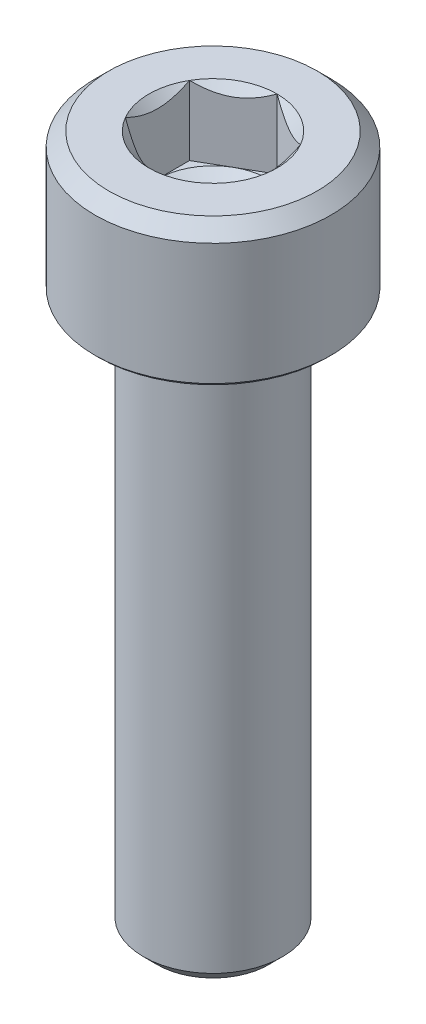
ISO-10303-21;
HEADER;
FILE_DESCRIPTION(('STEP AP214'),'2;1');
FILE_NAME('part.step','',(''),(''),'','','');
FILE_SCHEMA(('AUTOMOTIVE_DESIGN { 1 0 10303 214 1 1 1 1 }'));
ENDSEC;
DATA;
#1=APPLICATION_CONTEXT('core data for automotive mechanical design processes');
#2=APPLICATION_PROTOCOL_DEFINITION('international standard','automotive_design',2000,#1);
#3=PRODUCT_CONTEXT('',#1,'mechanical');
#4=PRODUCT('Part','Part','',(#3));
#5=PRODUCT_RELATED_PRODUCT_CATEGORY('part','',(#4));
#6=PRODUCT_DEFINITION_FORMATION('','',#4);
#7=PRODUCT_DEFINITION_CONTEXT('part definition',#1,'design');
#8=PRODUCT_DEFINITION('design','',#6,#7);
#9=PRODUCT_DEFINITION_SHAPE('','',#8);
#10=(LENGTH_UNIT() NAMED_UNIT(*) SI_UNIT(.MILLI.,.METRE.));
#11=(NAMED_UNIT(*) PLANE_ANGLE_UNIT() SI_UNIT($,.RADIAN.));
#12=(NAMED_UNIT(*) SI_UNIT($,.STERADIAN.) SOLID_ANGLE_UNIT());
#13=UNCERTAINTY_MEASURE_WITH_UNIT(LENGTH_MEASURE(1.E-05),#10,'distance_accuracy_value','');
#14=(GEOMETRIC_REPRESENTATION_CONTEXT(3) GLOBAL_UNCERTAINTY_ASSIGNED_CONTEXT((#13)) GLOBAL_UNIT_ASSIGNED_CONTEXT((#10,
#11,#12)) REPRESENTATION_CONTEXT('',''));
#15=CARTESIAN_POINT('',(0.,0.,0.));
#16=DIRECTION('',(0.,0.,1.));
#17=DIRECTION('',(1.,0.,0.));
#18=AXIS2_PLACEMENT_3D('',#15,#16,#17);
#19=CARTESIAN_POINT('',(0.,5.,0.));
#20=DIRECTION('',(0.,1.,0.));
#21=DIRECTION('',(0.,0.,1.));
#22=AXIS2_PLACEMENT_3D('',#19,#20,#21);
#23=CONICAL_SURFACE('',#22,2.3094010767585,0.785398163397443);
#24=CARTESIAN_POINT('',(0.,5.,0.));
#25=DIRECTION('',(0.,1.,0.));
#26=DIRECTION('',(0.,0.,1.));
#27=AXIS2_PLACEMENT_3D('',#24,#25,#26);
#28=CIRCLE('',#27,2.3094010767585);
#29=CARTESIAN_POINT('',(-2.,5.,-1.1547005383793));
#30=VERTEX_POINT('',#29);
#31=CARTESIAN_POINT('',(-1.99999999999995,5.,1.15470053837933));
#32=VERTEX_POINT('',#31);
#33=EDGE_CURVE('E248',#30,#32,#28,.T.);
#34=ORIENTED_EDGE('',*,*,#33,.T.);
#35=CARTESIAN_POINT('',(-2.,6.70865499521104,3.48493537924179));
#36=CARTESIAN_POINT('',(-2.,6.61927874799566,3.38184597960108));
#37=CARTESIAN_POINT('',(-2.,6.53042050100165,3.27829801866238));
#38=CARTESIAN_POINT('',(-2.,6.35410938767827,3.06992943838188));
#39=CARTESIAN_POINT('',(-2.,6.26665721017001,2.96510823693147));
#40=CARTESIAN_POINT('',(-2.,6.09162252246031,2.75150553836106));
#41=CARTESIAN_POINT('',(-2.,6.00408331853338,2.64268841410052));
#42=CARTESIAN_POINT('',(-2.,5.83166422486036,2.42300125193062));
#43=CARTESIAN_POINT('',(-2.,5.74678367399901,2.31213173546716));
#44=CARTESIAN_POINT('',(-2.,5.58057752677812,2.08751128165374));
#45=CARTESIAN_POINT('',(-2.,5.49925685260335,1.97375667808642));
#46=CARTESIAN_POINT('',(-2.,5.34184669326612,1.74250088545254));
#47=CARTESIAN_POINT('',(-2.,5.26576149836547,1.62499673652244));
#48=CARTESIAN_POINT('',(-2.,5.1220877183608,1.38607583721067));
#49=CARTESIAN_POINT('',(-2.,5.05443808556479,1.26469628611468));
#50=CARTESIAN_POINT('',(-2.,4.93125075275314,1.01594779490905));
#51=CARTESIAN_POINT('',(-2.,4.87569076817092,0.888590409780999));
#52=CARTESIAN_POINT('',(-2.,4.80571297250022,0.691083080219615));
#53=CARTESIAN_POINT('',(-2.,4.78445360220783,0.623368585918478));
#54=CARTESIAN_POINT('',(-2.,4.74782417137952,0.486345144048305));
#55=CARTESIAN_POINT('',(-2.,4.7324531708274,0.417036452850244));
#56=CARTESIAN_POINT('',(-2.,4.70862178314111,0.277659447369613));
#57=CARTESIAN_POINT('',(-2.,4.70011930731512,0.207598466966348));
#58=CARTESIAN_POINT('',(-2.,4.69049074221896,0.0669670350324534));
#59=CARTESIAN_POINT('',(-2.,4.68936387797233,-0.00360336219221853));
#60=CARTESIAN_POINT('',(-2.,4.69457684389318,-0.144553783114206));
#61=CARTESIAN_POINT('',(-2.,4.70092642398597,-0.214933437991822));
#62=CARTESIAN_POINT('',(-2.,4.72062790275544,-0.354698452121242));
#63=CARTESIAN_POINT('',(-2.,4.73398118039419,-0.424083612801693));
#64=CARTESIAN_POINT('',(-2.,4.76693306790516,-0.561849214257608));
#65=CARTESIAN_POINT('',(-2.,4.78657533412024,-0.630219027882827));
#66=CARTESIAN_POINT('',(-2.,4.83104362393443,-0.765224928840582));
#67=CARTESIAN_POINT('',(-2.,4.85586970498648,-0.831860996948566));
#68=CARTESIAN_POINT('',(-2.,4.91579733674519,-0.978223263821283));
#69=CARTESIAN_POINT('',(-2.,4.95195365366887,-1.05751393733744));
#70=CARTESIAN_POINT('',(-2.,5.02908857554939,-1.21373425446361));
#71=CARTESIAN_POINT('',(-2.,5.07006996654331,-1.29066250134966));
#72=CARTESIAN_POINT('',(-2.,5.15578343078954,-1.44259332598881));
#73=CARTESIAN_POINT('',(-2.,5.20052309801051,-1.51759158443124));
#74=CARTESIAN_POINT('',(-2.,5.29281710332292,-1.6658027451741));
#75=CARTESIAN_POINT('',(-2.,5.34037088158692,-1.73901599851123));
#76=CARTESIAN_POINT('',(-2.,5.43793273052148,-1.88434580060754));
#77=CARTESIAN_POINT('',(-2.,5.48795248279123,-1.95645447101685));
#78=CARTESIAN_POINT('',(-2.,5.58974868867912,-2.09942399496133));
#79=CARTESIAN_POINT('',(-2.,5.64152527469528,-2.17028475383773));
#80=CARTESIAN_POINT('',(-2.,5.79881562893284,-2.38113790846102));
#81=CARTESIAN_POINT('',(-2.,5.90641011816337,-2.51957625011744));
#82=CARTESIAN_POINT('',(-2.,6.12880481407568,-2.79793708137349));
#83=CARTESIAN_POINT('',(-2.,6.24372553752213,-2.93776233320845));
#84=CARTESIAN_POINT('',(-2.,6.4175122615703,-3.14503859467228));
#85=CARTESIAN_POINT('',(-2.,6.47535435122021,-3.21335225569823));
#86=CARTESIAN_POINT('',(-2.,6.59160375586807,-3.34949093797161));
#87=CARTESIAN_POINT('',(-2.,6.65001104087957,-3.41731598481301));
#88=CARTESIAN_POINT('',(-2.,6.70865499521104,-3.48493537924179));
#89=B_SPLINE_CURVE_WITH_KNOTS('',3,(#35,#36,#37,#38,#39,#40,#41,#42,#43,#44,#45,#46,#47,#48,#49,
#50,#51,#52,#53,#54,#55,#56,#57,#58,#59,#60,#61,#62,#63,#64,#65,#66,#67,#68,#69,#70,#71,#72,#73,
#74,#75,#76,#77,#78,#79,#80,#81,#82,#83,#84,#85,#86,#87,#88),.UNSPECIFIED.,.F.,.F.,(4,2,2,2,2,2,
2,2,2,2,2,2,2,2,2,2,2,2,2,2,2,2,2,2,2,2,4),(0.,0.409325277655496,0.818845319083793,
1.23778871017889,1.65662708384643,2.07602738016859,2.49576736290813,2.91226761680364,
3.32799351692011,3.54070099927128,3.75337451094884,3.96473470800344,4.17607269648514,
4.38768659336544,4.59934217067773,4.81250006998803,5.02566033188269,5.2868742678538,
5.54823977746819,5.8101467266179,6.07200174711857,6.33524589307928,6.59850992182926,
7.12440155307772,7.66733187119025,7.93586643479269,8.20438682857146),.UNSPECIFIED.);
#90=EDGE_CURVE('E135',#32,#30,#89,.T.);
#91=ORIENTED_EDGE('',*,*,#90,.T.);
#92=EDGE_LOOP('',(#34,#91));
#93=FACE_BOUND('',#92,.T.);
#94=ADVANCED_FACE('F43',(#93),#23,.F.);
#95=CARTESIAN_POINT('',(0.,5.,-2.3094010767585));
#96=VERTEX_POINT('',#95);
#97=EDGE_CURVE('E250',#96,#30,#28,.T.);
#98=ORIENTED_EDGE('',*,*,#97,.T.);
#99=CARTESIAN_POINT('',(-2.0002,5.00011547871369,-1.15458506832546));
#100=CARTESIAN_POINT('',(-1.93144696596929,4.96045309022562,-1.19427965103069));
#101=CARTESIAN_POINT('',(-1.86154425786449,4.92311998228419,-1.23463799837208));
#102=CARTESIAN_POINT('',(-1.71900475544956,4.85476368513617,-1.31693321846149));
#103=CARTESIAN_POINT('',(-1.64635440243464,4.82377853373725,-1.35887791933138));
#104=CARTESIAN_POINT('',(-1.49985839894602,4.77070021654417,-1.44345742638073));
#105=CARTESIAN_POINT('',(-1.4260500647537,4.74847362717663,-1.48607068799511));
#106=CARTESIAN_POINT('',(-1.27680836816473,4.7142288166751,-1.57223542169506));
#107=CARTESIAN_POINT('',(-1.20137956608184,4.70218502914416,-1.61578426088227));
#108=CARTESIAN_POINT('',(-1.07138449932891,4.69131851190559,-1.69083694766539));
#109=CARTESIAN_POINT('',(-1.01698621602988,4.68970975360999,-1.72224381117154));
#110=CARTESIAN_POINT('',(-0.908278544480294,4.69241887759873,-1.78500621460366));
#111=CARTESIAN_POINT('',(-0.853969194078648,4.69673883775799,-1.81636173267757));
#112=CARTESIAN_POINT('',(-0.745863272410649,4.71105956740992,-1.87877671565358));
#113=CARTESIAN_POINT('',(-0.692067343445194,4.72106669276202,-1.90983580972309));
#114=CARTESIAN_POINT('',(-0.585405737694413,4.74621243024967,-1.97141691651549));
#115=CARTESIAN_POINT('',(-0.532539989929274,4.76135064904225,-2.00193897021861));
#116=CARTESIAN_POINT('',(-0.397120266910144,4.8062945034292,-2.08012358375728));
#117=CARTESIAN_POINT('',(-0.315406165150512,4.83948883942583,-2.12730124240479));
#118=CARTESIAN_POINT('',(-0.195252962742192,4.89552582317138,-2.19667172615923));
#119=CARTESIAN_POINT('',(-0.155657147890818,4.91521470294695,-2.21953238052245));
#120=CARTESIAN_POINT('',(-0.0771990411121251,4.95638731836488,-2.26483018959124));
#121=CARTESIAN_POINT('',(-0.0383363164062583,4.97786995165125,-2.28726759416161));
#122=CARTESIAN_POINT('',(0.000200000000000129,5.00011547871366,-2.30951654681234));
#123=B_SPLINE_CURVE_WITH_KNOTS('',3,(#99,#100,#101,#102,#103,#104,#105,#106,#107,#108,#109,#110,
#111,#112,#113,#114,#115,#116,#117,#118,#119,#120,#121,#122),.UNSPECIFIED.,.F.,.F.,(4,2,2,2,2,2,
2,2,2,2,2,4),(0.,0.266420613771064,0.53439375152339,0.798110374376917,1.06116288956937,
1.24939906803722,1.43770123566248,1.62621426093932,1.81471283831913,2.11415604834143,
2.26347170717788,2.41269626969768),.UNSPECIFIED.);
#124=EDGE_CURVE('E210',#30,#96,#123,.T.);
#125=ORIENTED_EDGE('',*,*,#124,.T.);
#126=EDGE_LOOP('',(#98,#125));
#127=FACE_BOUND('',#126,.T.);
#128=ADVANCED_FACE('F294',(#127),#23,.F.);
#129=CARTESIAN_POINT('',(2.,5.,-1.1547005383793));
#130=VERTEX_POINT('',#129);
#131=EDGE_CURVE('E247',#130,#96,#28,.T.);
#132=ORIENTED_EDGE('',*,*,#131,.T.);
#133=CARTESIAN_POINT('',(-0.0002,5.00011547871366,-2.30951654681234));
#134=CARTESIAN_POINT('',(0.0685530340307034,4.96045309022559,-2.26982196410711));
#135=CARTESIAN_POINT('',(0.138455742135508,4.92311998228417,-2.22946361676572));
#136=CARTESIAN_POINT('',(0.280995244550428,4.85476368513615,-2.14716839667631));
#137=CARTESIAN_POINT('',(0.353645597565348,4.82377853373723,-2.10522369580643));
#138=CARTESIAN_POINT('',(0.500141601053956,4.77070021654416,-2.02064418875708));
#139=CARTESIAN_POINT('',(0.573949935246276,4.74847362717663,-1.97803092714271));
#140=CARTESIAN_POINT('',(0.723191631835241,4.7142288166751,-1.89186619344276));
#141=CARTESIAN_POINT('',(0.798620433918126,4.70218502914415,-1.84831735425555));
#142=CARTESIAN_POINT('',(0.928615500671051,4.69131851190559,-1.77326466747243));
#143=CARTESIAN_POINT('',(0.983013783970081,4.68970975360999,-1.74185780396629));
#144=CARTESIAN_POINT('',(1.09172145551967,4.69241887759873,-1.67909540053416));
#145=CARTESIAN_POINT('',(1.14603080592131,4.69673883775799,-1.64773988246026));
#146=CARTESIAN_POINT('',(1.25413672758931,4.71105956740992,-1.58532489948425));
#147=CARTESIAN_POINT('',(1.30793265655476,4.72106669276202,-1.55426580541474));
#148=CARTESIAN_POINT('',(1.41459426230555,4.74621243024968,-1.49268469862233));
#149=CARTESIAN_POINT('',(1.46746001007068,4.76135064904226,-1.46216264491922));
#150=CARTESIAN_POINT('',(1.60287973308982,4.80629450342921,-1.38397803138054));
#151=CARTESIAN_POINT('',(1.68459383484946,4.83948883942584,-1.33680037273302));
#152=CARTESIAN_POINT('',(1.80474703725779,4.89552582317139,-1.26742988897858));
#153=CARTESIAN_POINT('',(1.84434285210917,4.91521470294696,-1.24456923461536));
#154=CARTESIAN_POINT('',(1.92280095888787,4.9563873183649,-1.19927142554657));
#155=CARTESIAN_POINT('',(1.96166368359374,4.97786995165127,-1.17683402097619));
#156=CARTESIAN_POINT('',(2.0002,5.00011547871369,-1.15458506832546));
#157=B_SPLINE_CURVE_WITH_KNOTS('',3,(#133,#134,#135,#136,#137,#138,#139,#140,#141,#142,#143,
#144,#145,#146,#147,#148,#149,#150,#151,#152,#153,#154,#155,#156),.UNSPECIFIED.,.F.,.F.,(4,2,2,
2,2,2,2,2,2,2,2,4),(0.,0.266420613771052,0.534393751523364,0.798110374376878,1.06116288956932,
1.24939906803717,1.43770123566242,1.62621426093926,1.81471283831908,2.11415604834141,
2.26347170717787,2.41269626969768),.UNSPECIFIED.);
#158=EDGE_CURVE('E261',#96,#130,#157,.T.);
#159=ORIENTED_EDGE('',*,*,#158,.T.);
#160=EDGE_LOOP('',(#132,#159));
#161=FACE_BOUND('',#160,.T.);
#162=ADVANCED_FACE('F259',(#161),#23,.F.);
#163=CARTESIAN_POINT('',(2.,5.,1.1547005383793));
#164=VERTEX_POINT('',#163);
#165=EDGE_CURVE('E242',#164,#130,#28,.T.);
#166=ORIENTED_EDGE('',*,*,#165,.T.);
#167=CARTESIAN_POINT('',(2.,6.70865499521104,-3.48493537924179));
#168=CARTESIAN_POINT('',(2.,6.61927874799566,-3.38184597960108));
#169=CARTESIAN_POINT('',(2.,6.53042050100165,-3.27829801866238));
#170=CARTESIAN_POINT('',(2.,6.35410938767827,-3.06992943838188));
#171=CARTESIAN_POINT('',(2.,6.26665721017001,-2.96510823693147));
#172=CARTESIAN_POINT('',(2.,6.09162252246031,-2.75150553836106));
#173=CARTESIAN_POINT('',(2.,6.00408331853338,-2.64268841410052));
#174=CARTESIAN_POINT('',(2.,5.83166422486036,-2.42300125193062));
#175=CARTESIAN_POINT('',(2.,5.74678367399901,-2.31213173546716));
#176=CARTESIAN_POINT('',(2.,5.58057752677812,-2.08751128165374));
#177=CARTESIAN_POINT('',(2.,5.49925685260335,-1.97375667808642));
#178=CARTESIAN_POINT('',(2.,5.34184669326612,-1.74250088545254));
#179=CARTESIAN_POINT('',(2.,5.26576149836547,-1.62499673652244));
#180=CARTESIAN_POINT('',(2.,5.1220877183608,-1.38607583721067));
#181=CARTESIAN_POINT('',(2.,5.05443808556479,-1.26469628611468));
#182=CARTESIAN_POINT('',(2.,4.93125075275314,-1.01594779490905));
#183=CARTESIAN_POINT('',(2.,4.87569076817092,-0.888590409780999));
#184=CARTESIAN_POINT('',(2.,4.80571297250022,-0.691083080219615));
#185=CARTESIAN_POINT('',(2.,4.78445360220783,-0.623368585918478));
#186=CARTESIAN_POINT('',(2.,4.74782417137952,-0.486345144048305));
#187=CARTESIAN_POINT('',(2.,4.7324531708274,-0.417036452850244));
#188=CARTESIAN_POINT('',(2.,4.70862178314111,-0.277659447369613));
#189=CARTESIAN_POINT('',(2.,4.70011930731512,-0.207598466966348));
#190=CARTESIAN_POINT('',(2.,4.69049074221896,-0.0669670350324534));
#191=CARTESIAN_POINT('',(2.,4.68936387797233,0.00360336219221853));
#192=CARTESIAN_POINT('',(2.,4.69457684389318,0.144553783114206));
#193=CARTESIAN_POINT('',(2.,4.70092642398597,0.214933437991822));
#194=CARTESIAN_POINT('',(2.,4.72062790275544,0.354698452121242));
#195=CARTESIAN_POINT('',(2.,4.73398118039419,0.424083612801693));
#196=CARTESIAN_POINT('',(2.,4.76693306790516,0.561849214257608));
#197=CARTESIAN_POINT('',(2.,4.78657533412024,0.630219027882827));
#198=CARTESIAN_POINT('',(2.,4.83104362393443,0.765224928840582));
#199=CARTESIAN_POINT('',(2.,4.85586970498648,0.831860996948566));
#200=CARTESIAN_POINT('',(2.,4.91579733674519,0.978223263821283));
#201=CARTESIAN_POINT('',(2.,4.95195365366887,1.05751393733744));
#202=CARTESIAN_POINT('',(2.,5.02908857554939,1.21373425446361));
#203=CARTESIAN_POINT('',(2.,5.07006996654331,1.29066250134966));
#204=CARTESIAN_POINT('',(2.,5.15578343078954,1.44259332598881));
#205=CARTESIAN_POINT('',(2.,5.20052309801051,1.51759158443124));
#206=CARTESIAN_POINT('',(2.,5.29281710332292,1.6658027451741));
#207=CARTESIAN_POINT('',(2.,5.34037088158692,1.73901599851123));
#208=CARTESIAN_POINT('',(2.,5.43793273052148,1.88434580060754));
#209=CARTESIAN_POINT('',(2.,5.48795248279123,1.95645447101685));
#210=CARTESIAN_POINT('',(2.,5.58974868867912,2.09942399496133));
#211=CARTESIAN_POINT('',(2.,5.64152527469528,2.17028475383773));
#212=CARTESIAN_POINT('',(2.,5.79881562893284,2.38113790846102));
#213=CARTESIAN_POINT('',(2.,5.90641011816337,2.51957625011744));
#214=CARTESIAN_POINT('',(2.,6.12880481407568,2.79793708137349));
#215=CARTESIAN_POINT('',(2.,6.24372553752213,2.93776233320845));
#216=CARTESIAN_POINT('',(2.,6.4175122615703,3.14503859467228));
#217=CARTESIAN_POINT('',(2.,6.47535435122021,3.21335225569823));
#218=CARTESIAN_POINT('',(2.,6.59160375586807,3.34949093797161));
#219=CARTESIAN_POINT('',(2.,6.65001104087957,3.41731598481301));
#220=CARTESIAN_POINT('',(2.,6.70865499521104,3.48493537924179));
#221=B_SPLINE_CURVE_WITH_KNOTS('',3,(#167,#168,#169,#170,#171,#172,#173,#174,#175,#176,#177,
#178,#179,#180,#181,#182,#183,#184,#185,#186,#187,#188,#189,#190,#191,#192,#193,#194,#195,#196,
#197,#198,#199,#200,#201,#202,#203,#204,#205,#206,#207,#208,#209,#210,#211,#212,#213,#214,#215,
#216,#217,#218,#219,#220),.UNSPECIFIED.,.F.,.F.,(4,2,2,2,2,2,2,2,2,2,2,2,2,2,2,2,2,2,2,2,2,2,2,
2,2,2,4),(0.,0.409325277655496,0.818845319083793,1.23778871017889,1.65662708384643,
2.07602738016859,2.49576736290813,2.91226761680364,3.32799351692011,3.54070099927128,
3.75337451094884,3.96473470800344,4.17607269648514,4.38768659336544,4.59934217067773,
4.81250006998803,5.02566033188269,5.2868742678538,5.54823977746819,5.8101467266179,
6.07200174711857,6.33524589307928,6.59850992182926,7.12440155307772,7.66733187119025,
7.93586643479269,8.20438682857146),.UNSPECIFIED.);
#222=EDGE_CURVE('E269',#130,#164,#221,.T.);
#223=ORIENTED_EDGE('',*,*,#222,.T.);
#224=EDGE_LOOP('',(#166,#223));
#225=FACE_BOUND('',#224,.T.);
#226=ADVANCED_FACE('F268',(#225),#23,.F.);
#227=CARTESIAN_POINT('',(0.,5.,2.3094010767585));
#228=VERTEX_POINT('',#227);
#229=EDGE_CURVE('E240',#228,#164,#28,.T.);
#230=ORIENTED_EDGE('',*,*,#229,.T.);
#231=CARTESIAN_POINT('',(2.0002,5.00011547871369,1.15458506832546));
#232=CARTESIAN_POINT('',(1.93144696596929,4.96045309022562,1.19427965103069));
#233=CARTESIAN_POINT('',(1.86154425786449,4.92311998228419,1.23463799837208));
#234=CARTESIAN_POINT('',(1.71900475544956,4.85476368513617,1.31693321846149));
#235=CARTESIAN_POINT('',(1.64635440243464,4.82377853373725,1.35887791933138));
#236=CARTESIAN_POINT('',(1.49985839894602,4.77070021654417,1.44345742638073));
#237=CARTESIAN_POINT('',(1.4260500647537,4.74847362717663,1.48607068799511));
#238=CARTESIAN_POINT('',(1.27680836816473,4.7142288166751,1.57223542169506));
#239=CARTESIAN_POINT('',(1.20137956608184,4.70218502914416,1.61578426088227));
#240=CARTESIAN_POINT('',(1.07138449932891,4.69131851190559,1.69083694766539));
#241=CARTESIAN_POINT('',(1.01698621602988,4.68970975360999,1.72224381117154));
#242=CARTESIAN_POINT('',(0.908278544480294,4.69241887759873,1.78500621460366));
#243=CARTESIAN_POINT('',(0.853969194078648,4.69673883775799,1.81636173267757));
#244=CARTESIAN_POINT('',(0.745863272410649,4.71105956740992,1.87877671565358));
#245=CARTESIAN_POINT('',(0.692067343445194,4.72106669276202,1.90983580972309));
#246=CARTESIAN_POINT('',(0.585405737694413,4.74621243024967,1.97141691651549));
#247=CARTESIAN_POINT('',(0.532539989929274,4.76135064904225,2.00193897021861));
#248=CARTESIAN_POINT('',(0.397120266910144,4.8062945034292,2.08012358375728));
#249=CARTESIAN_POINT('',(0.315406165150512,4.83948883942583,2.12730124240479));
#250=CARTESIAN_POINT('',(0.195252962742192,4.89552582317138,2.19667172615923));
#251=CARTESIAN_POINT('',(0.155657147890818,4.91521470294695,2.21953238052245));
#252=CARTESIAN_POINT('',(0.0771990411121251,4.95638731836488,2.26483018959124));
#253=CARTESIAN_POINT('',(0.0383363164062583,4.97786995165125,2.28726759416161));
#254=CARTESIAN_POINT('',(-0.000200000000000129,5.00011547871366,2.30951654681234));
#255=B_SPLINE_CURVE_WITH_KNOTS('',3,(#231,#232,#233,#234,#235,#236,#237,#238,#239,#240,#241,
#242,#243,#244,#245,#246,#247,#248,#249,#250,#251,#252,#253,#254),.UNSPECIFIED.,.F.,.F.,(4,2,2,
2,2,2,2,2,2,2,2,4),(0.,0.266420613771064,0.53439375152339,0.798110374376917,1.06116288956937,
1.24939906803722,1.43770123566248,1.62621426093932,1.81471283831913,2.11415604834143,
2.26347170717788,2.41269626969768),.UNSPECIFIED.);
#256=EDGE_CURVE('E179',#164,#228,#255,.T.);
#257=ORIENTED_EDGE('',*,*,#256,.T.);
#258=EDGE_LOOP('',(#230,#257));
#259=FACE_BOUND('',#258,.T.);
#260=ADVANCED_FACE('F299',(#259),#23,.F.);
#261=EDGE_CURVE('E239',#32,#228,#28,.T.);
#262=ORIENTED_EDGE('',*,*,#261,.T.);
#263=CARTESIAN_POINT('',(0.0002,5.00011547871366,2.30951654681234));
#264=CARTESIAN_POINT('',(-0.0685530340307034,4.96045309022559,2.26982196410711));
#265=CARTESIAN_POINT('',(-0.138455742135508,4.92311998228417,2.22946361676572));
#266=CARTESIAN_POINT('',(-0.280995244550428,4.85476368513615,2.14716839667631));
#267=CARTESIAN_POINT('',(-0.353645597565348,4.82377853373723,2.10522369580643));
#268=CARTESIAN_POINT('',(-0.500141601053956,4.77070021654416,2.02064418875708));
#269=CARTESIAN_POINT('',(-0.573949935246276,4.74847362717663,1.97803092714271));
#270=CARTESIAN_POINT('',(-0.723191631835241,4.7142288166751,1.89186619344276));
#271=CARTESIAN_POINT('',(-0.798620433918126,4.70218502914415,1.84831735425555));
#272=CARTESIAN_POINT('',(-0.928615500671051,4.69131851190559,1.77326466747243));
#273=CARTESIAN_POINT('',(-0.983013783970081,4.68970975360999,1.74185780396629));
#274=CARTESIAN_POINT('',(-1.09172145551967,4.69241887759873,1.67909540053416));
#275=CARTESIAN_POINT('',(-1.14603080592131,4.69673883775799,1.64773988246026));
#276=CARTESIAN_POINT('',(-1.25413672758931,4.71105956740992,1.58532489948425));
#277=CARTESIAN_POINT('',(-1.30793265655476,4.72106669276202,1.55426580541474));
#278=CARTESIAN_POINT('',(-1.41459426230555,4.74621243024968,1.49268469862233));
#279=CARTESIAN_POINT('',(-1.46746001007068,4.76135064904226,1.46216264491922));
#280=CARTESIAN_POINT('',(-1.60287973308982,4.80629450342921,1.38397803138054));
#281=CARTESIAN_POINT('',(-1.68459383484946,4.83948883942584,1.33680037273302));
#282=CARTESIAN_POINT('',(-1.80474703725779,4.89552582317139,1.26742988897858));
#283=CARTESIAN_POINT('',(-1.84434285210917,4.91521470294696,1.24456923461536));
#284=CARTESIAN_POINT('',(-1.92280095888787,4.9563873183649,1.19927142554657));
#285=CARTESIAN_POINT('',(-1.96166368359374,4.97786995165127,1.17683402097619));
#286=CARTESIAN_POINT('',(-2.0002,5.00011547871369,1.15458506832546));
#287=B_SPLINE_CURVE_WITH_KNOTS('',3,(#263,#264,#265,#266,#267,#268,#269,#270,#271,#272,#273,
#274,#275,#276,#277,#278,#279,#280,#281,#282,#283,#284,#285,#286),.UNSPECIFIED.,.F.,.F.,(4,2,2,
2,2,2,2,2,2,2,2,4),(0.,0.266420613771052,0.534393751523364,0.798110374376878,1.06116288956932,
1.24939906803717,1.43770123566242,1.62621426093926,1.81471283831908,2.11415604834141,
2.26347170717787,2.41269626969768),.UNSPECIFIED.);
#288=EDGE_CURVE('E66',#228,#32,#287,.T.);
#289=ORIENTED_EDGE('',*,*,#288,.T.);
#290=EDGE_LOOP('',(#262,#289));
#291=FACE_BOUND('',#290,.T.);
#292=ADVANCED_FACE('F186',(#291),#23,.F.);
#293=CARTESIAN_POINT('',(2.3094010767585,5.,0.));
#294=DIRECTION('',(0.,-1.,0.));
#295=DIRECTION('',(0.,0.,-1.));
#296=AXIS2_PLACEMENT_3D('',#293,#294,#295);
#297=PLANE('',#296);
#298=ORIENTED_EDGE('',*,*,#229,.F.);
#299=ORIENTED_EDGE('',*,*,#261,.F.);
#300=ORIENTED_EDGE('',*,*,#33,.F.);
#301=ORIENTED_EDGE('',*,*,#97,.F.);
#302=ORIENTED_EDGE('',*,*,#131,.F.);
#303=ORIENTED_EDGE('',*,*,#165,.F.);
#304=EDGE_LOOP('',(#298,#299,#300,#301,#302,#303));
#305=FACE_BOUND('',#304,.T.);
#306=CARTESIAN_POINT('',(0.,5.,0.));
#307=DIRECTION('',(0.,1.,0.));
#308=DIRECTION('',(0.,0.,1.));
#309=AXIS2_PLACEMENT_3D('',#306,#307,#308);
#310=CIRCLE('',#309,3.75);
#311=CARTESIAN_POINT('',(0.,5.,3.75));
#312=VERTEX_POINT('',#311);
#313=EDGE_CURVE('E237',#312,#312,#310,.T.);
#314=ORIENTED_EDGE('',*,*,#313,.T.);
#315=EDGE_LOOP('',(#314));
#316=FACE_BOUND('',#315,.T.);
#317=ADVANCED_FACE('F265',(#305,#316),#297,.F.);
#318=CARTESIAN_POINT('',(0.,4.5,0.));
#319=DIRECTION('',(0.,-1.,0.));
#320=DIRECTION('',(0.,0.,-1.));
#321=AXIS2_PLACEMENT_3D('',#318,#319,#320);
#322=CONICAL_SURFACE('',#321,4.25,0.785398163397448);
#323=ORIENTED_EDGE('',*,*,#313,.F.);
#324=EDGE_LOOP('',(#323));
#325=FACE_BOUND('',#324,.T.);
#326=CARTESIAN_POINT('',(0.,4.5,0.));
#327=DIRECTION('',(0.,1.,0.));
#328=DIRECTION('',(0.,0.,1.));
#329=AXIS2_PLACEMENT_3D('',#326,#327,#328);
#330=CIRCLE('',#329,4.25);
#331=CARTESIAN_POINT('',(0.,4.5,4.25));
#332=VERTEX_POINT('',#331);
#333=EDGE_CURVE('E234',#332,#332,#330,.T.);
#334=ORIENTED_EDGE('',*,*,#333,.T.);
#335=EDGE_LOOP('',(#334));
#336=FACE_BOUND('',#335,.T.);
#337=ADVANCED_FACE('F304',(#325,#336),#322,.T.);
#338=CARTESIAN_POINT('',(0.,-20.,0.));
#339=DIRECTION('',(0.,1.,0.));
#340=DIRECTION('',(0.,0.,1.));
#341=AXIS2_PLACEMENT_3D('',#338,#339,#340);
#342=CYLINDRICAL_SURFACE('',#341,4.25);
#343=ORIENTED_EDGE('',*,*,#333,.F.);
#344=EDGE_LOOP('',(#343));
#345=FACE_BOUND('',#344,.T.);
#346=CARTESIAN_POINT('',(0.,0.125,0.));
#347=DIRECTION('',(0.,1.,0.));
#348=DIRECTION('',(0.,0.,1.));
#349=AXIS2_PLACEMENT_3D('',#346,#347,#348);
#350=CIRCLE('',#349,4.25);
#351=CARTESIAN_POINT('',(0.,0.125,4.25));
#352=VERTEX_POINT('',#351);
#353=EDGE_CURVE('E231',#352,#352,#350,.T.);
#354=ORIENTED_EDGE('',*,*,#353,.T.);
#355=EDGE_LOOP('',(#354));
#356=FACE_BOUND('',#355,.T.);
#357=ADVANCED_FACE('F382',(#345,#356),#342,.T.);
#358=CARTESIAN_POINT('',(0.,0.,0.));
#359=DIRECTION('',(0.,1.,0.));
#360=DIRECTION('',(0.,0.,1.));
#361=AXIS2_PLACEMENT_3D('',#358,#359,#360);
#362=CONICAL_SURFACE('',#361,4.125,0.785398163397448);
#363=ORIENTED_EDGE('',*,*,#353,.F.);
#364=EDGE_LOOP('',(#363));
#365=FACE_BOUND('',#364,.T.);
#366=CARTESIAN_POINT('',(0.,0.,0.));
#367=DIRECTION('',(0.,1.,0.));
#368=DIRECTION('',(0.,0.,1.));
#369=AXIS2_PLACEMENT_3D('',#366,#367,#368);
#370=CIRCLE('',#369,4.125);
#371=CARTESIAN_POINT('',(0.,0.,4.125));
#372=VERTEX_POINT('',#371);
#373=EDGE_CURVE('E228',#372,#372,#370,.T.);
#374=ORIENTED_EDGE('',*,*,#373,.T.);
#375=EDGE_LOOP('',(#374));
#376=FACE_BOUND('',#375,.T.);
#377=ADVANCED_FACE('F386',(#365,#376),#362,.T.);
#378=CARTESIAN_POINT('',(4.125,0.,0.));
#379=DIRECTION('',(0.,1.,0.));
#380=DIRECTION('',(0.,0.,1.));
#381=AXIS2_PLACEMENT_3D('',#378,#379,#380);
#382=PLANE('',#381);
#383=ORIENTED_EDGE('',*,*,#373,.F.);
#384=EDGE_LOOP('',(#383));
#385=FACE_BOUND('',#384,.T.);
#386=CARTESIAN_POINT('',(0.,0.,0.));
#387=DIRECTION('',(0.,1.,0.));
#388=DIRECTION('',(0.,0.,1.));
#389=AXIS2_PLACEMENT_3D('',#386,#387,#388);
#390=CIRCLE('',#389,2.55);
#391=CARTESIAN_POINT('',(0.,0.,2.55));
#392=VERTEX_POINT('',#391);
#393=EDGE_CURVE('E225',#392,#392,#390,.T.);
#394=ORIENTED_EDGE('',*,*,#393,.T.);
#395=EDGE_LOOP('',(#394));
#396=FACE_BOUND('',#395,.T.);
#397=ADVANCED_FACE('F442',(#385,#396),#382,.F.);
#398=CARTESIAN_POINT('',(0.,-0.6,0.));
#399=DIRECTION('',(0.,1.,0.));
#400=DIRECTION('',(0.,0.,1.));
#401=AXIS2_PLACEMENT_3D('',#398,#399,#400);
#402=CONICAL_SURFACE('',#401,2.5,0.0831412318884407);
#403=ORIENTED_EDGE('',*,*,#393,.F.);
#404=EDGE_LOOP('',(#403));
#405=FACE_BOUND('',#404,.T.);
#406=CARTESIAN_POINT('',(0.,-0.6,0.));
#407=DIRECTION('',(0.,1.,0.));
#408=DIRECTION('',(0.,0.,1.));
#409=AXIS2_PLACEMENT_3D('',#406,#407,#408);
#410=CIRCLE('',#409,2.5);
#411=CARTESIAN_POINT('',(0.,-0.6,2.5));
#412=VERTEX_POINT('',#411);
#413=EDGE_CURVE('E222',#412,#412,#410,.T.);
#414=ORIENTED_EDGE('',*,*,#413,.T.);
#415=EDGE_LOOP('',(#414));
#416=FACE_BOUND('',#415,.T.);
#417=ADVANCED_FACE('F431',(#405,#416),#402,.T.);
#418=CARTESIAN_POINT('',(0.,-20.,0.));
#419=DIRECTION('',(0.,1.,0.));
#420=DIRECTION('',(0.,0.,1.));
#421=AXIS2_PLACEMENT_3D('',#418,#419,#420);
#422=CYLINDRICAL_SURFACE('',#421,2.5);
#423=ORIENTED_EDGE('',*,*,#413,.F.);
#424=EDGE_LOOP('',(#423));
#425=FACE_BOUND('',#424,.T.);
#426=CARTESIAN_POINT('',(0.,-19.5095,0.));
#427=DIRECTION('',(0.,1.,0.));
#428=DIRECTION('',(0.,0.,1.));
#429=AXIS2_PLACEMENT_3D('',#426,#427,#428);
#430=CIRCLE('',#429,2.5);
#431=CARTESIAN_POINT('',(0.,-19.5095,2.5));
#432=VERTEX_POINT('',#431);
#433=EDGE_CURVE('E219',#432,#432,#430,.T.);
#434=ORIENTED_EDGE('',*,*,#433,.T.);
#435=EDGE_LOOP('',(#434));
#436=FACE_BOUND('',#435,.T.);
#437=ADVANCED_FACE('F325',(#425,#436),#422,.T.);
#438=CARTESIAN_POINT('',(0.,-20.,0.));
#439=DIRECTION('',(0.,1.,0.));
#440=DIRECTION('',(0.,0.,1.));
#441=AXIS2_PLACEMENT_3D('',#438,#439,#440);
#442=CONICAL_SURFACE('',#441,2.0095,0.785398163397447);
#443=ORIENTED_EDGE('',*,*,#433,.F.);
#444=EDGE_LOOP('',(#443));
#445=FACE_BOUND('',#444,.T.);
#446=CARTESIAN_POINT('',(0.,-20.,0.));
#447=DIRECTION('',(0.,1.,0.));
#448=DIRECTION('',(0.,0.,1.));
#449=AXIS2_PLACEMENT_3D('',#446,#447,#448);
#450=CIRCLE('',#449,2.0095);
#451=CARTESIAN_POINT('',(0.,-20.,2.0095));
#452=VERTEX_POINT('',#451);
#453=EDGE_CURVE('E209',#452,#452,#450,.T.);
#454=ORIENTED_EDGE('',*,*,#453,.T.);
#455=EDGE_LOOP('',(#454));
#456=FACE_BOUND('',#455,.T.);
#457=ADVANCED_FACE('F408',(#445,#456),#442,.T.);
#458=CARTESIAN_POINT('',(2.0095,-20.,0.));
#459=DIRECTION('',(0.,1.,0.));
#460=DIRECTION('',(0.,0.,1.));
#461=AXIS2_PLACEMENT_3D('',#458,#459,#460);
#462=PLANE('',#461);
#463=ORIENTED_EDGE('',*,*,#453,.F.);
#464=EDGE_LOOP('',(#463));
#465=FACE_BOUND('',#464,.T.);
#466=ADVANCED_FACE('F200',(#465),#462,.F.);
#467=CARTESIAN_POINT('',(0.,2.5,0.));
#468=DIRECTION('',(0.,1.,0.));
#469=DIRECTION('',(0.,0.,1.));
#470=AXIS2_PLACEMENT_3D('',#467,#468,#469);
#471=PLANE('',#470);
#472=CARTESIAN_POINT('',(0.,2.5,0.));
#473=DIRECTION('',(0.,1.,0.));
#474=DIRECTION('',(0.,0.,1.));
#475=AXIS2_PLACEMENT_3D('',#472,#473,#474);
#476=CIRCLE('',#475,2.);
#477=CARTESIAN_POINT('',(-2.,2.5,0.));
#478=VERTEX_POINT('',#477);
#479=CARTESIAN_POINT('',(-0.999999999999976,2.5,1.73205080756891));
#480=VERTEX_POINT('',#479);
#481=EDGE_CURVE('E125',#478,#480,#476,.T.);
#482=ORIENTED_EDGE('',*,*,#481,.F.);
#483=DIRECTION('',(0.,0.,1.));
#484=VECTOR('',#483,1.);
#485=CARTESIAN_POINT('',(-2.,2.5,-1.1547005383793));
#486=LINE('',#485,#484);
#487=CARTESIAN_POINT('',(-2.,2.5,1.1547005383793));
#488=VERTEX_POINT('',#487);
#489=EDGE_CURVE('E119',#478,#488,#486,.T.);
#490=ORIENTED_EDGE('',*,*,#489,.T.);
#491=DIRECTION('',(0.866025403784448,0.,0.499999999999983));
#492=VECTOR('',#491,1.);
#493=CARTESIAN_POINT('',(-2.,2.5,1.1547005383793));
#494=LINE('',#493,#492);
#495=EDGE_CURVE('E123',#488,#480,#494,.T.);
#496=ORIENTED_EDGE('',*,*,#495,.T.);
#497=EDGE_LOOP('',(#482,#490,#496));
#498=FACE_BOUND('',#497,.T.);
#499=ADVANCED_FACE('F121',(#498),#471,.T.);
#500=CARTESIAN_POINT('',(-0.999999999999976,2.5,-1.73205080756891));
#501=VERTEX_POINT('',#500);
#502=EDGE_CURVE('E532',#501,#478,#476,.T.);
#503=ORIENTED_EDGE('',*,*,#502,.F.);
#504=DIRECTION('',(-0.866025403784448,0.,0.499999999999983));
#505=VECTOR('',#504,1.);
#506=CARTESIAN_POINT('',(0.,2.5,-2.3094010767585));
#507=LINE('',#506,#505);
#508=CARTESIAN_POINT('',(-2.,2.5,-1.1547005383793));
#509=VERTEX_POINT('',#508);
#510=EDGE_CURVE('E157',#501,#509,#507,.T.);
#511=ORIENTED_EDGE('',*,*,#510,.T.);
#512=EDGE_CURVE('E129',#509,#478,#486,.T.);
#513=ORIENTED_EDGE('',*,*,#512,.T.);
#514=EDGE_LOOP('',(#503,#511,#513));
#515=FACE_BOUND('',#514,.T.);
#516=ADVANCED_FACE('F292',(#515),#471,.T.);
#517=CARTESIAN_POINT('',(0.999999999999976,2.5,-1.73205080756891));
#518=VERTEX_POINT('',#517);
#519=EDGE_CURVE('E531',#518,#501,#476,.T.);
#520=ORIENTED_EDGE('',*,*,#519,.F.);
#521=DIRECTION('',(-0.866025403784448,0.,-0.499999999999983));
#522=VECTOR('',#521,1.);
#523=CARTESIAN_POINT('',(2.,2.5,-1.1547005383793));
#524=LINE('',#523,#522);
#525=CARTESIAN_POINT('',(0.,2.5,-2.3094010767585));
#526=VERTEX_POINT('',#525);
#527=EDGE_CURVE('E153',#518,#526,#524,.T.);
#528=ORIENTED_EDGE('',*,*,#527,.T.);
#529=EDGE_CURVE('E139',#526,#501,#507,.T.);
#530=ORIENTED_EDGE('',*,*,#529,.T.);
#531=EDGE_LOOP('',(#520,#528,#530));
#532=FACE_BOUND('',#531,.T.);
#533=ADVANCED_FACE('F476',(#532),#471,.T.);
#534=CARTESIAN_POINT('',(2.,2.5,0.));
#535=VERTEX_POINT('',#534);
#536=EDGE_CURVE('E51',#535,#518,#476,.T.);
#537=ORIENTED_EDGE('',*,*,#536,.F.);
#538=DIRECTION('',(0.,0.,-1.));
#539=VECTOR('',#538,1.);
#540=CARTESIAN_POINT('',(2.,2.5,1.1547005383793));
#541=LINE('',#540,#539);
#542=CARTESIAN_POINT('',(2.,2.5,-1.1547005383793));
#543=VERTEX_POINT('',#542);
#544=EDGE_CURVE('E149',#535,#543,#541,.T.);
#545=ORIENTED_EDGE('',*,*,#544,.T.);
#546=EDGE_CURVE('E154',#543,#518,#524,.T.);
#547=ORIENTED_EDGE('',*,*,#546,.T.);
#548=EDGE_LOOP('',(#537,#545,#547));
#549=FACE_BOUND('',#548,.T.);
#550=ADVANCED_FACE('F290',(#549),#471,.T.);
#551=CARTESIAN_POINT('',(0.999999999999966,2.5,1.7320508075689));
#552=VERTEX_POINT('',#551);
#553=EDGE_CURVE('E11',#552,#535,#476,.T.);
#554=ORIENTED_EDGE('',*,*,#553,.F.);
#555=DIRECTION('',(0.866025403784448,0.,-0.499999999999983));
#556=VECTOR('',#555,1.);
#557=CARTESIAN_POINT('',(0.,2.5,2.3094010767585));
#558=LINE('',#557,#556);
#559=CARTESIAN_POINT('',(2.,2.5,1.1547005383793));
#560=VERTEX_POINT('',#559);
#561=EDGE_CURVE('E145',#552,#560,#558,.T.);
#562=ORIENTED_EDGE('',*,*,#561,.T.);
#563=EDGE_CURVE('E150',#560,#535,#541,.T.);
#564=ORIENTED_EDGE('',*,*,#563,.T.);
#565=EDGE_LOOP('',(#554,#562,#564));
#566=FACE_BOUND('',#565,.T.);
#567=ADVANCED_FACE('F280',(#566),#471,.T.);
#568=EDGE_CURVE('E52',#480,#552,#476,.T.);
#569=ORIENTED_EDGE('',*,*,#568,.F.);
#570=CARTESIAN_POINT('',(0.,2.5,2.3094010767585));
#571=VERTEX_POINT('',#570);
#572=EDGE_CURVE('E144',#480,#571,#494,.T.);
#573=ORIENTED_EDGE('',*,*,#572,.T.);
#574=EDGE_CURVE('E59',#571,#552,#558,.T.);
#575=ORIENTED_EDGE('',*,*,#574,.T.);
#576=EDGE_LOOP('',(#569,#573,#575));
#577=FACE_BOUND('',#576,.T.);
#578=ADVANCED_FACE('F199',(#577),#471,.T.);
#579=CARTESIAN_POINT('',(-2.,2.5,-1.1547005383793));
#580=DIRECTION('',(-1.,0.,0.));
#581=DIRECTION('',(0.,0.,1.));
#582=AXIS2_PLACEMENT_3D('',#579,#580,#581);
#583=PLANE('',#582);
#584=ORIENTED_EDGE('',*,*,#90,.F.);
#585=DIRECTION('',(0.,1.,0.));
#586=VECTOR('',#585,1.);
#587=CARTESIAN_POINT('',(-2.,2.5,1.1547005383793));
#588=LINE('',#587,#586);
#589=EDGE_CURVE('E132',#488,#32,#588,.T.);
#590=ORIENTED_EDGE('',*,*,#589,.F.);
#591=ORIENTED_EDGE('',*,*,#489,.F.);
#592=ORIENTED_EDGE('',*,*,#512,.F.);
#593=DIRECTION('',(0.,1.,0.));
#594=VECTOR('',#593,1.);
#595=CARTESIAN_POINT('',(-2.,2.5,-1.1547005383793));
#596=LINE('',#595,#594);
#597=EDGE_CURVE('E160',#509,#30,#596,.T.);
#598=ORIENTED_EDGE('',*,*,#597,.T.);
#599=EDGE_LOOP('',(#584,#590,#591,#592,#598));
#600=FACE_BOUND('',#599,.T.);
#601=ADVANCED_FACE('F133',(#600),#583,.F.);
#602=CARTESIAN_POINT('',(0.,2.5,-2.3094010767585));
#603=DIRECTION('',(-0.499999999999983,0.,-0.866025403784448));
#604=DIRECTION('',(-0.866025403784448,0.,0.499999999999983));
#605=AXIS2_PLACEMENT_3D('',#602,#603,#604);
#606=PLANE('',#605);
#607=ORIENTED_EDGE('',*,*,#124,.F.);
#608=ORIENTED_EDGE('',*,*,#597,.F.);
#609=ORIENTED_EDGE('',*,*,#510,.F.);
#610=ORIENTED_EDGE('',*,*,#529,.F.);
#611=DIRECTION('',(0.,1.,0.));
#612=VECTOR('',#611,1.);
#613=CARTESIAN_POINT('',(0.,2.5,-2.3094010767585));
#614=LINE('',#613,#612);
#615=EDGE_CURVE('E162',#526,#96,#614,.T.);
#616=ORIENTED_EDGE('',*,*,#615,.T.);
#617=EDGE_LOOP('',(#607,#608,#609,#610,#616));
#618=FACE_BOUND('',#617,.T.);
#619=ADVANCED_FACE('F198',(#618),#606,.F.);
#620=CARTESIAN_POINT('',(2.,2.5,-1.1547005383793));
#621=DIRECTION('',(0.499999999999983,0.,-0.866025403784448));
#622=DIRECTION('',(-0.866025403784448,0.,-0.499999999999983));
#623=AXIS2_PLACEMENT_3D('',#620,#621,#622);
#624=PLANE('',#623);
#625=ORIENTED_EDGE('',*,*,#158,.F.);
#626=ORIENTED_EDGE('',*,*,#615,.F.);
#627=ORIENTED_EDGE('',*,*,#527,.F.);
#628=ORIENTED_EDGE('',*,*,#546,.F.);
#629=DIRECTION('',(0.,1.,0.));
#630=VECTOR('',#629,1.);
#631=CARTESIAN_POINT('',(2.,2.5,-1.1547005383793));
#632=LINE('',#631,#630);
#633=EDGE_CURVE('E165',#543,#130,#632,.T.);
#634=ORIENTED_EDGE('',*,*,#633,.T.);
#635=EDGE_LOOP('',(#625,#626,#627,#628,#634));
#636=FACE_BOUND('',#635,.T.);
#637=ADVANCED_FACE('F332',(#636),#624,.F.);
#638=CARTESIAN_POINT('',(2.,2.5,1.1547005383793));
#639=DIRECTION('',(1.,0.,0.));
#640=DIRECTION('',(0.,0.,-1.));
#641=AXIS2_PLACEMENT_3D('',#638,#639,#640);
#642=PLANE('',#641);
#643=ORIENTED_EDGE('',*,*,#222,.F.);
#644=ORIENTED_EDGE('',*,*,#633,.F.);
#645=ORIENTED_EDGE('',*,*,#544,.F.);
#646=ORIENTED_EDGE('',*,*,#563,.F.);
#647=DIRECTION('',(0.,1.,0.));
#648=VECTOR('',#647,1.);
#649=CARTESIAN_POINT('',(2.,2.5,1.1547005383793));
#650=LINE('',#649,#648);
#651=EDGE_CURVE('E168',#560,#164,#650,.T.);
#652=ORIENTED_EDGE('',*,*,#651,.T.);
#653=EDGE_LOOP('',(#643,#644,#645,#646,#652));
#654=FACE_BOUND('',#653,.T.);
#655=ADVANCED_FACE('F276',(#654),#642,.F.);
#656=CARTESIAN_POINT('',(0.,2.5,2.3094010767585));
#657=DIRECTION('',(0.499999999999983,0.,0.866025403784448));
#658=DIRECTION('',(0.866025403784448,0.,-0.499999999999983));
#659=AXIS2_PLACEMENT_3D('',#656,#657,#658);
#660=PLANE('',#659);
#661=ORIENTED_EDGE('',*,*,#256,.F.);
#662=ORIENTED_EDGE('',*,*,#651,.F.);
#663=ORIENTED_EDGE('',*,*,#561,.F.);
#664=ORIENTED_EDGE('',*,*,#574,.F.);
#665=DIRECTION('',(0.,1.,0.));
#666=VECTOR('',#665,1.);
#667=CARTESIAN_POINT('',(0.,2.5,2.3094010767585));
#668=LINE('',#667,#666);
#669=EDGE_CURVE('E138',#571,#228,#668,.T.);
#670=ORIENTED_EDGE('',*,*,#669,.T.);
#671=EDGE_LOOP('',(#661,#662,#663,#664,#670));
#672=FACE_BOUND('',#671,.T.);
#673=ADVANCED_FACE('F192',(#672),#660,.F.);
#674=CARTESIAN_POINT('',(-2.,2.5,1.1547005383793));
#675=DIRECTION('',(-0.499999999999983,0.,0.866025403784448));
#676=DIRECTION('',(0.866025403784448,0.,0.499999999999983));
#677=AXIS2_PLACEMENT_3D('',#674,#675,#676);
#678=PLANE('',#677);
#679=ORIENTED_EDGE('',*,*,#288,.F.);
#680=ORIENTED_EDGE('',*,*,#669,.F.);
#681=ORIENTED_EDGE('',*,*,#572,.F.);
#682=ORIENTED_EDGE('',*,*,#495,.F.);
#683=ORIENTED_EDGE('',*,*,#589,.T.);
#684=EDGE_LOOP('',(#679,#680,#681,#682,#683));
#685=FACE_BOUND('',#684,.T.);
#686=ADVANCED_FACE('F142',(#685),#678,.F.);
#687=CARTESIAN_POINT('',(0.,2.5,0.));
#688=DIRECTION('',(0.,1.,0.));
#689=DIRECTION('',(0.,0.,1.));
#690=AXIS2_PLACEMENT_3D('',#687,#688,#689);
#691=CONICAL_SURFACE('',#690,2.,1.04719755119658);
#692=CARTESIAN_POINT('',(0.,1.3452994616207,0.));
#693=VERTEX_POINT('',#692);
#694=VERTEX_LOOP('',#693);
#695=FACE_BOUND('',#694,.T.);
#696=ORIENTED_EDGE('',*,*,#553,.T.);
#697=ORIENTED_EDGE('',*,*,#536,.T.);
#698=ORIENTED_EDGE('',*,*,#519,.T.);
#699=ORIENTED_EDGE('',*,*,#502,.T.);
#700=ORIENTED_EDGE('',*,*,#481,.T.);
#701=ORIENTED_EDGE('',*,*,#568,.T.);
#702=EDGE_LOOP('',(#696,#697,#698,#699,#700,#701));
#703=FACE_BOUND('',#702,.T.);
#704=ADVANCED_FACE('F45',(#695,#703),#691,.F.);
#705=CLOSED_SHELL('',(#94,#128,#162,#226,#260,#292,#317,#337,#357,#377,#397,#417,#437,#457,#466,
#499,#516,#533,#550,#567,#578,#601,#619,#637,#655,#673,#686,#704));
#706=MANIFOLD_SOLID_BREP('B2',#705);
#707=ADVANCED_BREP_SHAPE_REPRESENTATION('',(#18,#706),#14);
#708=SHAPE_DEFINITION_REPRESENTATION(#9,#707);
ENDSEC;
END-ISO-10303-21;
